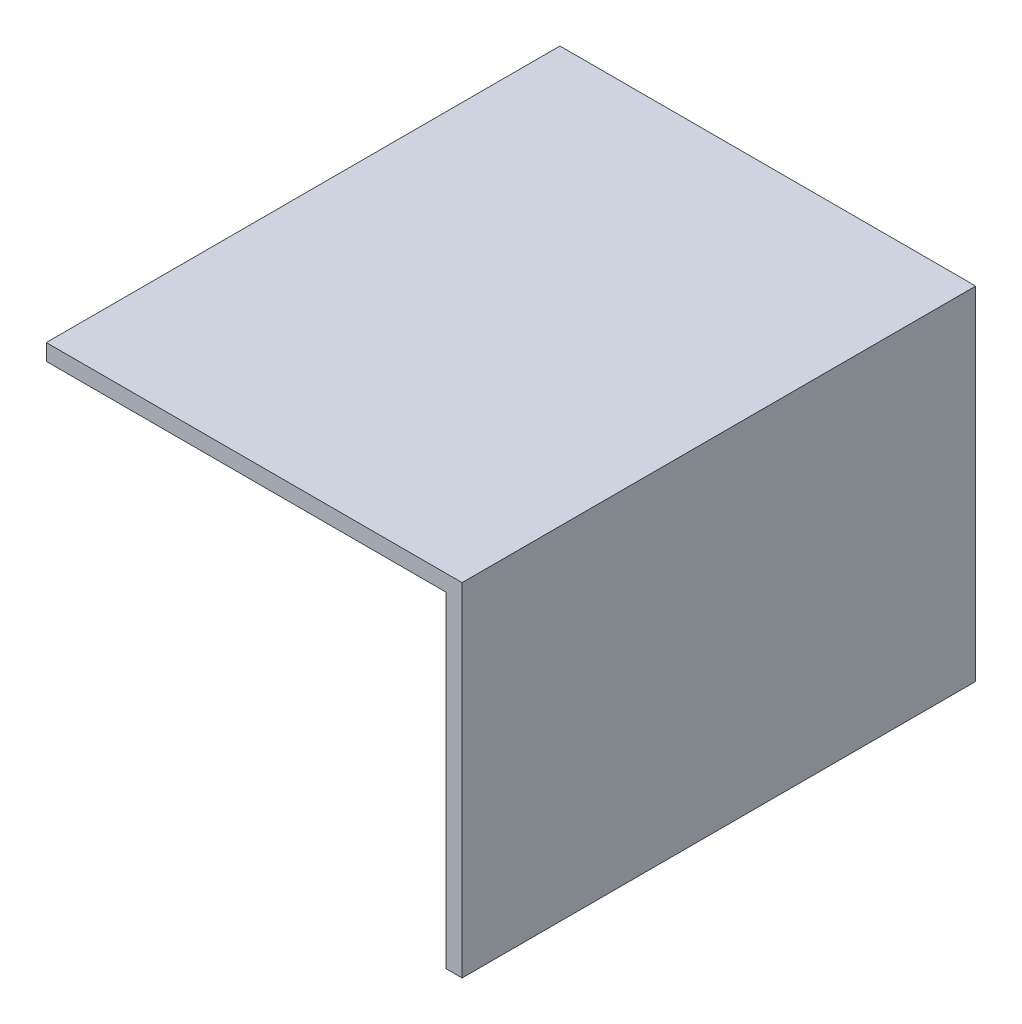
ISO-10303-21;
HEADER;
FILE_DESCRIPTION(('STEP AP214'),'2;1');
FILE_NAME('part.step','',(''),(''),'','','');
FILE_SCHEMA(('AUTOMOTIVE_DESIGN { 1 0 10303 214 1 1 1 1 }'));
ENDSEC;
DATA;
#1=APPLICATION_CONTEXT('core data for automotive mechanical design processes');
#2=APPLICATION_PROTOCOL_DEFINITION('international standard','automotive_design',2000,#1);
#3=PRODUCT_CONTEXT('',#1,'mechanical');
#4=PRODUCT('Part','Part','',(#3));
#5=PRODUCT_RELATED_PRODUCT_CATEGORY('part','',(#4));
#6=PRODUCT_DEFINITION_FORMATION('','',#4);
#7=PRODUCT_DEFINITION_CONTEXT('part definition',#1,'design');
#8=PRODUCT_DEFINITION('design','',#6,#7);
#9=PRODUCT_DEFINITION_SHAPE('','',#8);
#10=(LENGTH_UNIT() NAMED_UNIT(*) SI_UNIT(.MILLI.,.METRE.));
#11=(NAMED_UNIT(*) PLANE_ANGLE_UNIT() SI_UNIT($,.RADIAN.));
#12=(NAMED_UNIT(*) SI_UNIT($,.STERADIAN.) SOLID_ANGLE_UNIT());
#13=UNCERTAINTY_MEASURE_WITH_UNIT(LENGTH_MEASURE(1.E-05),#10,'distance_accuracy_value','');
#14=(GEOMETRIC_REPRESENTATION_CONTEXT(3) GLOBAL_UNCERTAINTY_ASSIGNED_CONTEXT((#13)) GLOBAL_UNIT_ASSIGNED_CONTEXT((#10,
#11,#12)) REPRESENTATION_CONTEXT('',''));
#15=CARTESIAN_POINT('',(0.,0.,0.));
#16=DIRECTION('',(0.,0.,1.));
#17=DIRECTION('',(1.,0.,0.));
#18=AXIS2_PLACEMENT_3D('',#15,#16,#17);
#19=CARTESIAN_POINT('',(25.5,42.,31.5));
#20=DIRECTION('',(-1.,0.,0.));
#21=DIRECTION('',(0.,0.,1.));
#22=AXIS2_PLACEMENT_3D('',#19,#20,#21);
#23=PLANE('',#22);
#24=DIRECTION('',(0.,0.,-1.));
#25=VECTOR('',#24,1.);
#26=CARTESIAN_POINT('',(25.5,0.,31.5));
#27=LINE('',#26,#25);
#28=CARTESIAN_POINT('',(25.5,0.,31.5));
#29=VERTEX_POINT('',#28);
#30=CARTESIAN_POINT('',(25.5,0.,-31.5));
#31=VERTEX_POINT('',#30);
#32=EDGE_CURVE('E137',#29,#31,#27,.T.);
#33=ORIENTED_EDGE('',*,*,#32,.T.);
#34=DIRECTION('',(0.,-1.,0.));
#35=VECTOR('',#34,1.);
#36=CARTESIAN_POINT('',(25.5,42.,-31.5));
#37=LINE('',#36,#35);
#38=CARTESIAN_POINT('',(25.5,42.,-31.5));
#39=VERTEX_POINT('',#38);
#40=EDGE_CURVE('E11',#39,#31,#37,.T.);
#41=ORIENTED_EDGE('',*,*,#40,.F.);
#42=DIRECTION('',(0.,0.,-1.));
#43=VECTOR('',#42,1.);
#44=CARTESIAN_POINT('',(25.5,42.,31.5));
#45=LINE('',#44,#43);
#46=CARTESIAN_POINT('',(25.5,42.,31.5));
#47=VERTEX_POINT('',#46);
#48=EDGE_CURVE('E133',#47,#39,#45,.T.);
#49=ORIENTED_EDGE('',*,*,#48,.F.);
#50=DIRECTION('',(0.,-1.,0.));
#51=VECTOR('',#50,1.);
#52=CARTESIAN_POINT('',(25.5,42.,31.5));
#53=LINE('',#52,#51);
#54=EDGE_CURVE('E126',#47,#29,#53,.T.);
#55=ORIENTED_EDGE('',*,*,#54,.T.);
#56=EDGE_LOOP('',(#33,#41,#49,#55));
#57=FACE_BOUND('',#56,.T.);
#58=ADVANCED_FACE('F39',(#57),#23,.F.);
#59=CARTESIAN_POINT('',(-25.5,42.,-31.5));
#60=DIRECTION('',(0.,0.,1.));
#61=DIRECTION('',(1.,0.,0.));
#62=AXIS2_PLACEMENT_3D('',#59,#60,#61);
#63=PLANE('',#62);
#64=DIRECTION('',(-1.,0.,0.));
#65=VECTOR('',#64,1.);
#66=CARTESIAN_POINT('',(-25.5,0.,-31.5));
#67=LINE('',#66,#65);
#68=CARTESIAN_POINT('',(23.5,0.,-31.5));
#69=VERTEX_POINT('',#68);
#70=EDGE_CURVE('E134',#31,#69,#67,.T.);
#71=ORIENTED_EDGE('',*,*,#70,.T.);
#72=DIRECTION('',(0.,-1.,0.));
#73=VECTOR('',#72,1.);
#74=CARTESIAN_POINT('',(23.5,40.,-31.5));
#75=LINE('',#74,#73);
#76=CARTESIAN_POINT('',(23.5,40.,-31.5));
#77=VERTEX_POINT('',#76);
#78=EDGE_CURVE('E54',#77,#69,#75,.T.);
#79=ORIENTED_EDGE('',*,*,#78,.F.);
#80=DIRECTION('',(1.,0.,0.));
#81=VECTOR('',#80,1.);
#82=CARTESIAN_POINT('',(-25.5,40.,-31.5));
#83=LINE('',#82,#81);
#84=CARTESIAN_POINT('',(-25.5,40.,-31.5));
#85=VERTEX_POINT('',#84);
#86=EDGE_CURVE('E105',#85,#77,#83,.T.);
#87=ORIENTED_EDGE('',*,*,#86,.F.);
#88=DIRECTION('',(0.,-1.,0.));
#89=VECTOR('',#88,1.);
#90=CARTESIAN_POINT('',(-25.5,42.,-31.5));
#91=LINE('',#90,#89);
#92=CARTESIAN_POINT('',(-25.5,42.,-31.5));
#93=VERTEX_POINT('',#92);
#94=EDGE_CURVE('E47',#93,#85,#91,.T.);
#95=ORIENTED_EDGE('',*,*,#94,.F.);
#96=DIRECTION('',(-1.,0.,0.));
#97=VECTOR('',#96,1.);
#98=CARTESIAN_POINT('',(-25.5,42.,-31.5));
#99=LINE('',#98,#97);
#100=EDGE_CURVE('E85',#39,#93,#99,.T.);
#101=ORIENTED_EDGE('',*,*,#100,.F.);
#102=ORIENTED_EDGE('',*,*,#40,.T.);
#103=EDGE_LOOP('',(#71,#79,#87,#95,#101,#102));
#104=FACE_BOUND('',#103,.T.);
#105=ADVANCED_FACE('F116',(#104),#63,.F.);
#106=CARTESIAN_POINT('',(-25.5,42.,31.5));
#107=DIRECTION('',(1.,0.,0.));
#108=DIRECTION('',(0.,0.,-1.));
#109=AXIS2_PLACEMENT_3D('',#106,#107,#108);
#110=PLANE('',#109);
#111=ORIENTED_EDGE('',*,*,#94,.T.);
#112=DIRECTION('',(0.,0.,-1.));
#113=VECTOR('',#112,1.);
#114=CARTESIAN_POINT('',(-25.5,40.,-31.5));
#115=LINE('',#114,#113);
#116=CARTESIAN_POINT('',(-25.5,40.,31.5));
#117=VERTEX_POINT('',#116);
#118=EDGE_CURVE('E101',#117,#85,#115,.T.);
#119=ORIENTED_EDGE('',*,*,#118,.F.);
#120=DIRECTION('',(0.,-1.,0.));
#121=VECTOR('',#120,1.);
#122=CARTESIAN_POINT('',(-25.5,42.,31.5));
#123=LINE('',#122,#121);
#124=CARTESIAN_POINT('',(-25.5,42.,31.5));
#125=VERTEX_POINT('',#124);
#126=EDGE_CURVE('E124',#125,#117,#123,.T.);
#127=ORIENTED_EDGE('',*,*,#126,.F.);
#128=DIRECTION('',(0.,0.,1.));
#129=VECTOR('',#128,1.);
#130=CARTESIAN_POINT('',(-25.5,42.,31.5));
#131=LINE('',#130,#129);
#132=EDGE_CURVE('E122',#93,#125,#131,.T.);
#133=ORIENTED_EDGE('',*,*,#132,.F.);
#134=EDGE_LOOP('',(#111,#119,#127,#133));
#135=FACE_BOUND('',#134,.T.);
#136=ADVANCED_FACE('F121',(#135),#110,.F.);
#137=CARTESIAN_POINT('',(-25.5,42.,31.5));
#138=DIRECTION('',(0.,0.,-1.));
#139=DIRECTION('',(-1.,0.,0.));
#140=AXIS2_PLACEMENT_3D('',#137,#138,#139);
#141=PLANE('',#140);
#142=DIRECTION('',(-1.,0.,0.));
#143=VECTOR('',#142,1.);
#144=CARTESIAN_POINT('',(-25.5,40.,31.5));
#145=LINE('',#144,#143);
#146=CARTESIAN_POINT('',(23.5,40.,31.5));
#147=VERTEX_POINT('',#146);
#148=EDGE_CURVE('E107',#147,#117,#145,.T.);
#149=ORIENTED_EDGE('',*,*,#148,.F.);
#150=DIRECTION('',(0.,-1.,0.));
#151=VECTOR('',#150,1.);
#152=CARTESIAN_POINT('',(23.5,40.,31.5));
#153=LINE('',#152,#151);
#154=CARTESIAN_POINT('',(23.5,0.,31.5));
#155=VERTEX_POINT('',#154);
#156=EDGE_CURVE('E141',#147,#155,#153,.T.);
#157=ORIENTED_EDGE('',*,*,#156,.T.);
#158=DIRECTION('',(1.,0.,0.));
#159=VECTOR('',#158,1.);
#160=CARTESIAN_POINT('',(-25.5,0.,31.5));
#161=LINE('',#160,#159);
#162=EDGE_CURVE('E78',#155,#29,#161,.T.);
#163=ORIENTED_EDGE('',*,*,#162,.T.);
#164=ORIENTED_EDGE('',*,*,#54,.F.);
#165=DIRECTION('',(1.,0.,0.));
#166=VECTOR('',#165,1.);
#167=CARTESIAN_POINT('',(-25.5,42.,31.5));
#168=LINE('',#167,#166);
#169=EDGE_CURVE('E63',#125,#47,#168,.T.);
#170=ORIENTED_EDGE('',*,*,#169,.F.);
#171=ORIENTED_EDGE('',*,*,#126,.T.);
#172=EDGE_LOOP('',(#149,#157,#163,#164,#170,#171));
#173=FACE_BOUND('',#172,.T.);
#174=ADVANCED_FACE('F159',(#173),#141,.F.);
#175=CARTESIAN_POINT('',(0.,42.,0.));
#176=DIRECTION('',(0.,-1.,0.));
#177=DIRECTION('',(0.,0.,-1.));
#178=AXIS2_PLACEMENT_3D('',#175,#176,#177);
#179=PLANE('',#178);
#180=ORIENTED_EDGE('',*,*,#48,.T.);
#181=ORIENTED_EDGE('',*,*,#100,.T.);
#182=ORIENTED_EDGE('',*,*,#132,.T.);
#183=ORIENTED_EDGE('',*,*,#169,.T.);
#184=EDGE_LOOP('',(#180,#181,#182,#183));
#185=FACE_BOUND('',#184,.T.);
#186=ADVANCED_FACE('F164',(#185),#179,.F.);
#187=CARTESIAN_POINT('',(0.,0.,0.));
#188=DIRECTION('',(0.,-1.,0.));
#189=DIRECTION('',(0.,0.,-1.));
#190=AXIS2_PLACEMENT_3D('',#187,#188,#189);
#191=PLANE('',#190);
#192=DIRECTION('',(0.,0.,1.));
#193=VECTOR('',#192,1.);
#194=CARTESIAN_POINT('',(23.5,0.,-31.5));
#195=LINE('',#194,#193);
#196=EDGE_CURVE('E113',#69,#155,#195,.T.);
#197=ORIENTED_EDGE('',*,*,#196,.F.);
#198=ORIENTED_EDGE('',*,*,#70,.F.);
#199=ORIENTED_EDGE('',*,*,#32,.F.);
#200=ORIENTED_EDGE('',*,*,#162,.F.);
#201=EDGE_LOOP('',(#197,#198,#199,#200));
#202=FACE_BOUND('',#201,.T.);
#203=ADVANCED_FACE('F166',(#202),#191,.T.);
#204=CARTESIAN_POINT('',(23.5,40.,-31.5));
#205=DIRECTION('',(1.,0.,0.));
#206=DIRECTION('',(0.,0.,-1.));
#207=AXIS2_PLACEMENT_3D('',#204,#205,#206);
#208=PLANE('',#207);
#209=ORIENTED_EDGE('',*,*,#196,.T.);
#210=ORIENTED_EDGE('',*,*,#156,.F.);
#211=DIRECTION('',(0.,0.,1.));
#212=VECTOR('',#211,1.);
#213=CARTESIAN_POINT('',(23.5,40.,-31.5));
#214=LINE('',#213,#212);
#215=EDGE_CURVE('E119',#77,#147,#214,.T.);
#216=ORIENTED_EDGE('',*,*,#215,.F.);
#217=ORIENTED_EDGE('',*,*,#78,.T.);
#218=EDGE_LOOP('',(#209,#210,#216,#217));
#219=FACE_BOUND('',#218,.T.);
#220=ADVANCED_FACE('F172',(#219),#208,.F.);
#221=CARTESIAN_POINT('',(0.,40.,0.));
#222=DIRECTION('',(0.,1.,0.));
#223=DIRECTION('',(0.,0.,1.));
#224=AXIS2_PLACEMENT_3D('',#221,#222,#223);
#225=PLANE('',#224);
#226=ORIENTED_EDGE('',*,*,#118,.T.);
#227=ORIENTED_EDGE('',*,*,#86,.T.);
#228=ORIENTED_EDGE('',*,*,#215,.T.);
#229=ORIENTED_EDGE('',*,*,#148,.T.);
#230=EDGE_LOOP('',(#226,#227,#228,#229));
#231=FACE_BOUND('',#230,.T.);
#232=ADVANCED_FACE('F103',(#231),#225,.F.);
#233=CLOSED_SHELL('',(#58,#105,#136,#174,#186,#203,#220,#232));
#234=MANIFOLD_SOLID_BREP('B2',#233);
#235=ADVANCED_BREP_SHAPE_REPRESENTATION('',(#18,#234),#14);
#236=SHAPE_DEFINITION_REPRESENTATION(#9,#235);
ENDSEC;
END-ISO-10303-21;
